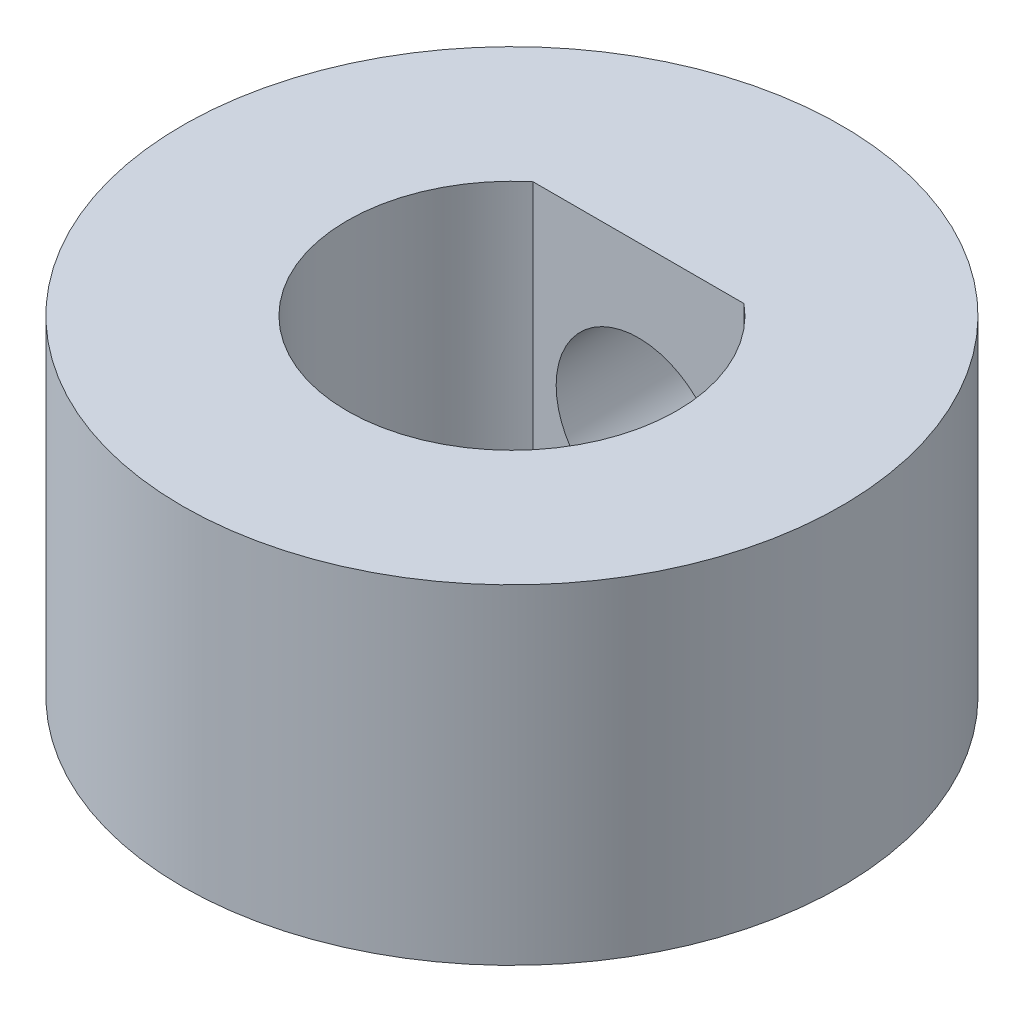
ISO-10303-21;
HEADER;
FILE_DESCRIPTION(('STEP AP214'),'2;1');
FILE_NAME('part.step','',(''),(''),'','','');
FILE_SCHEMA(('AUTOMOTIVE_DESIGN { 1 0 10303 214 1 1 1 1 }'));
ENDSEC;
DATA;
#1=APPLICATION_CONTEXT('core data for automotive mechanical design processes');
#2=APPLICATION_PROTOCOL_DEFINITION('international standard','automotive_design',2000,#1);
#3=PRODUCT_CONTEXT('',#1,'mechanical');
#4=PRODUCT('Part','Part','',(#3));
#5=PRODUCT_RELATED_PRODUCT_CATEGORY('part','',(#4));
#6=PRODUCT_DEFINITION_FORMATION('','',#4);
#7=PRODUCT_DEFINITION_CONTEXT('part definition',#1,'design');
#8=PRODUCT_DEFINITION('design','',#6,#7);
#9=PRODUCT_DEFINITION_SHAPE('','',#8);
#10=(LENGTH_UNIT() NAMED_UNIT(*) SI_UNIT(.MILLI.,.METRE.));
#11=(NAMED_UNIT(*) PLANE_ANGLE_UNIT() SI_UNIT($,.RADIAN.));
#12=(NAMED_UNIT(*) SI_UNIT($,.STERADIAN.) SOLID_ANGLE_UNIT());
#13=UNCERTAINTY_MEASURE_WITH_UNIT(LENGTH_MEASURE(1.E-05),#10,'distance_accuracy_value','');
#14=(GEOMETRIC_REPRESENTATION_CONTEXT(3) GLOBAL_UNCERTAINTY_ASSIGNED_CONTEXT((#13)) GLOBAL_UNIT_ASSIGNED_CONTEXT((#10,
#11,#12)) REPRESENTATION_CONTEXT('',''));
#15=CARTESIAN_POINT('',(0.,0.,0.));
#16=DIRECTION('',(0.,0.,1.));
#17=DIRECTION('',(1.,0.,0.));
#18=AXIS2_PLACEMENT_3D('',#15,#16,#17);
#19=CARTESIAN_POINT('',(0.,6.35,-2.43959033446192));
#20=DIRECTION('',(0.,0.,-1.));
#21=DIRECTION('',(-1.,0.,0.));
#22=AXIS2_PLACEMENT_3D('',#19,#20,#21);
#23=PLANE('',#22);
#24=CARTESIAN_POINT('',(0.,3.175,-2.43959033446191));
#25=DIRECTION('',(0.,0.,-1.));
#26=DIRECTION('',(-1.,0.,0.));
#27=AXIS2_PLACEMENT_3D('',#24,#25,#26);
#28=CIRCLE('',#27,1.5875);
#29=CARTESIAN_POINT('',(-1.5875,3.175,-2.43959033446191));
#30=VERTEX_POINT('',#29);
#31=EDGE_CURVE('E68',#30,#30,#28,.F.);
#32=ORIENTED_EDGE('',*,*,#31,.F.);
#33=EDGE_LOOP('',(#32));
#34=FACE_BOUND('',#33,.T.);
#35=DIRECTION('',(1.,0.,0.));
#36=VECTOR('',#35,1.);
#37=CARTESIAN_POINT('',(0.,0.,-2.43959033446192));
#38=LINE('',#37,#36);
#39=CARTESIAN_POINT('',(-2.032,0.,-2.43959033446192));
#40=VERTEX_POINT('',#39);
#41=CARTESIAN_POINT('',(2.032,0.,-2.43959033446192));
#42=VERTEX_POINT('',#41);
#43=EDGE_CURVE('E59',#40,#42,#38,.T.);
#44=ORIENTED_EDGE('',*,*,#43,.T.);
#45=DIRECTION('',(0.,-1.,0.));
#46=VECTOR('',#45,1.);
#47=CARTESIAN_POINT('',(2.032,6.35,-2.43959033446192));
#48=LINE('',#47,#46);
#49=CARTESIAN_POINT('',(2.032,6.35,-2.43959033446192));
#50=VERTEX_POINT('',#49);
#51=EDGE_CURVE('E11',#50,#42,#48,.T.);
#52=ORIENTED_EDGE('',*,*,#51,.F.);
#53=DIRECTION('',(1.,0.,0.));
#54=VECTOR('',#53,1.);
#55=CARTESIAN_POINT('',(0.,6.35,-2.43959033446192));
#56=LINE('',#55,#54);
#57=CARTESIAN_POINT('',(-2.032,6.35,-2.43959033446192));
#58=VERTEX_POINT('',#57);
#59=EDGE_CURVE('E61',#58,#50,#56,.T.);
#60=ORIENTED_EDGE('',*,*,#59,.F.);
#61=DIRECTION('',(0.,-1.,0.));
#62=VECTOR('',#61,1.);
#63=CARTESIAN_POINT('',(-2.032,6.35,-2.43959033446192));
#64=LINE('',#63,#62);
#65=EDGE_CURVE('E43',#58,#40,#64,.T.);
#66=ORIENTED_EDGE('',*,*,#65,.T.);
#67=EDGE_LOOP('',(#44,#52,#60,#66));
#68=FACE_BOUND('',#67,.T.);
#69=ADVANCED_FACE('F35',(#34,#68),#23,.F.);
#70=CARTESIAN_POINT('',(0.,6.35,0.));
#71=DIRECTION('',(0.,-1.,0.));
#72=DIRECTION('',(0.,0.,-1.));
#73=AXIS2_PLACEMENT_3D('',#70,#71,#72);
#74=CYLINDRICAL_SURFACE('',#73,3.175);
#75=CARTESIAN_POINT('',(0.,0.,0.));
#76=DIRECTION('',(0.,1.,0.));
#77=DIRECTION('',(0.,0.,1.));
#78=AXIS2_PLACEMENT_3D('',#75,#76,#77);
#79=CIRCLE('',#78,3.175);
#80=EDGE_CURVE('E67',#40,#42,#79,.T.);
#81=ORIENTED_EDGE('',*,*,#80,.F.);
#82=ORIENTED_EDGE('',*,*,#65,.F.);
#83=CARTESIAN_POINT('',(0.,6.35,0.));
#84=DIRECTION('',(0.,1.,0.));
#85=DIRECTION('',(0.,0.,1.));
#86=AXIS2_PLACEMENT_3D('',#83,#84,#85);
#87=CIRCLE('',#86,3.175);
#88=EDGE_CURVE('E78',#58,#50,#87,.T.);
#89=ORIENTED_EDGE('',*,*,#88,.T.);
#90=ORIENTED_EDGE('',*,*,#51,.T.);
#91=EDGE_LOOP('',(#81,#82,#89,#90));
#92=FACE_BOUND('',#91,.T.);
#93=ADVANCED_FACE('F70',(#92),#74,.F.);
#94=CARTESIAN_POINT('',(0.,6.35,0.));
#95=DIRECTION('',(0.,-1.,0.));
#96=DIRECTION('',(0.,0.,-1.));
#97=AXIS2_PLACEMENT_3D('',#94,#95,#96);
#98=CYLINDRICAL_SURFACE('',#97,6.35);
#99=CARTESIAN_POINT('',(-1.5875,3.175,-6.14836106210427));
#100=CARTESIAN_POINT('',(-1.58749750990578,3.26266222683713,-6.14836273554171));
#101=CARTESIAN_POINT('',(-1.58021416589079,3.35035201066053,-6.15025634318835));
#102=CARTESIAN_POINT('',(-1.55131968466973,3.52321341214051,-6.15760682365713));
#103=CARTESIAN_POINT('',(-1.5297002087813,3.60838353408739,-6.16306577024851));
#104=CARTESIAN_POINT('',(-1.47287691176629,3.77368024674877,-6.17689090118439));
#105=CARTESIAN_POINT('',(-1.43769062718759,3.8538131936699,-6.18525333108409));
#106=CARTESIAN_POINT('',(-1.35478592470099,4.00704739136285,-6.20393851938293));
#107=CARTESIAN_POINT('',(-1.30706697473604,4.08014834342094,-6.21426136100349));
#108=CARTESIAN_POINT('',(-1.19932985134304,4.2188521447415,-6.23595854885813));
#109=CARTESIAN_POINT('',(-1.13908642369207,4.28427743622228,-6.24734969490624));
#110=CARTESIAN_POINT('',(-1.00849561070392,4.40420848541882,-6.26975425952214));
#111=CARTESIAN_POINT('',(-0.938147281804495,4.45871322226981,-6.28076764269657));
#112=CARTESIAN_POINT('',(-0.788127202685136,4.55598242194586,-6.30136163855569));
#113=CARTESIAN_POINT('',(-0.708339055883901,4.59857245648253,-6.31092011499376));
#114=CARTESIAN_POINT('',(-0.542457122025904,4.66966912403721,-6.32733565573));
#115=CARTESIAN_POINT('',(-0.456364267477882,4.69817783496635,-6.33419311857309));
#116=CARTESIAN_POINT('',(-0.282167811808892,4.7397338749574,-6.34431521868594));
#117=CARTESIAN_POINT('',(-0.194140276913599,4.75308272414738,-6.34764982591139));
#118=CARTESIAN_POINT('',(-0.0170363002318583,4.76488657083998,-6.35059432258134));
#119=CARTESIAN_POINT('',(0.0720399845316736,4.76334377035309,-6.35020476271407));
#120=CARTESIAN_POINT('',(0.246621692386165,4.74562497009116,-6.34579690295494));
#121=CARTESIAN_POINT('',(0.332162492266694,4.7297744335908,-6.34185931486455));
#122=CARTESIAN_POINT('',(0.499329467769227,4.6844132435192,-6.33089181193282));
#123=CARTESIAN_POINT('',(0.58095543475057,4.65490186278535,-6.3238617324801));
#124=CARTESIAN_POINT('',(0.738833141809118,4.58279336761371,-6.30737568660069));
#125=CARTESIAN_POINT('',(0.815029659254325,4.54008042663979,-6.29789837506359));
#126=CARTESIAN_POINT('',(0.959287550465525,4.44286914376118,-6.27754588919127));
#127=CARTESIAN_POINT('',(1.02734750569824,4.38836875146401,-6.26667047179331));
#128=CARTESIAN_POINT('',(1.15534128069737,4.26738494884119,-6.24435958243645));
#129=CARTESIAN_POINT('',(1.21500531553188,4.20061714335916,-6.23291691898958));
#130=CARTESIAN_POINT('',(1.32234999684129,4.05790401680194,-6.21103052633108));
#131=CARTESIAN_POINT('',(1.37003008322305,3.98195826702322,-6.20058684382291));
#132=CARTESIAN_POINT('',(1.45222615482337,3.82251582831541,-6.18185515488097));
#133=CARTESIAN_POINT('',(1.48667718756565,3.73898431125112,-6.17357784665833));
#134=CARTESIAN_POINT('',(1.54096342276019,3.56705822777145,-6.16025336488873));
#135=CARTESIAN_POINT('',(1.56080175290274,3.47866470637071,-6.15520550014489));
#136=CARTESIAN_POINT('',(1.58485182055239,3.30202571653282,-6.14905651084854));
#137=CARTESIAN_POINT('',(1.58946245093896,3.21383800123569,-6.14785466574466));
#138=CARTESIAN_POINT('',(1.58401828897737,3.03795307027287,-6.1492596311046));
#139=CARTESIAN_POINT('',(1.57396484663399,2.95025581020096,-6.15186609096804));
#140=CARTESIAN_POINT('',(1.53982766960041,2.77932244175376,-6.16049747041146));
#141=CARTESIAN_POINT('',(1.51597618335891,2.69603681862751,-6.16646576098828));
#142=CARTESIAN_POINT('',(1.45517748186084,2.53464602426418,-6.18109456102061));
#143=CARTESIAN_POINT('',(1.41822871529747,2.45654146799986,-6.1897553893787));
#144=CARTESIAN_POINT('',(1.33144937413971,2.30603978855423,-6.20900547054222));
#145=CARTESIAN_POINT('',(1.28138031368562,2.23378468657263,-6.21962922065218));
#146=CARTESIAN_POINT('',(1.17008321503345,2.09855538962114,-6.2415234775054));
#147=CARTESIAN_POINT('',(1.10885334300364,2.0355827229272,-6.25279409032578));
#148=CARTESIAN_POINT('',(0.975142069563252,1.91908998796744,-6.2750535092507));
#149=CARTESIAN_POINT('',(0.902417474643903,1.8658458602815,-6.28602820809266));
#150=CARTESIAN_POINT('',(0.748828008777797,1.77232572448596,-6.30616732549721));
#151=CARTESIAN_POINT('',(0.667963562720176,1.73204903995379,-6.31533183847515));
#152=CARTESIAN_POINT('',(0.500948645248106,1.66595676807476,-6.33076023493829));
#153=CARTESIAN_POINT('',(0.414841342381762,1.6400371794193,-6.3370449206423));
#154=CARTESIAN_POINT('',(0.239315244506108,1.60308268752366,-6.34609661306326));
#155=CARTESIAN_POINT('',(0.149897092002975,1.5920449117007,-6.34886429864815));
#156=CARTESIAN_POINT('',(-0.0271200982287803,1.58532895154884,-6.35054243936488));
#157=CARTESIAN_POINT('',(-0.114702950308577,1.58924353681107,-6.34955516472013));
#158=CARTESIAN_POINT('',(-0.287920900558399,1.61138842582975,-6.3440611062616));
#159=CARTESIAN_POINT('',(-0.373556056577157,1.6296183038333,-6.33955442711888));
#160=CARTESIAN_POINT('',(-0.540021519086145,1.67965789888635,-6.32754374655666));
#161=CARTESIAN_POINT('',(-0.620875210147367,1.71139398213697,-6.32005601147982));
#162=CARTESIAN_POINT('',(-0.776155821703331,1.78747829419318,-6.30287171149997));
#163=CARTESIAN_POINT('',(-0.850581930508269,1.83182811286294,-6.29317486818656));
#164=CARTESIAN_POINT('',(-0.99282556137294,1.93312293397035,-6.27232758869116));
#165=CARTESIAN_POINT('',(-1.06044204392718,1.99034422686546,-6.26114789401158));
#166=CARTESIAN_POINT('',(-1.18525134468062,2.1152212775084,-6.23872655372022));
#167=CARTESIAN_POINT('',(-1.24244151604575,2.18287967680543,-6.22748489312182));
#168=CARTESIAN_POINT('',(-1.34582221703577,2.32822974504462,-6.2059736792862));
#169=CARTESIAN_POINT('',(-1.3917876333714,2.40608504591755,-6.19572617421192));
#170=CARTESIAN_POINT('',(-1.46990894837737,2.56866309025229,-6.17766029436602));
#171=CARTESIAN_POINT('',(-1.50207489424355,2.65338078369445,-6.16984015341641));
#172=CARTESIAN_POINT('',(-1.54689576409763,2.81079100627491,-6.15873655124406));
#173=CARTESIAN_POINT('',(-1.56208915832016,2.88273039845938,-6.15487502513368));
#174=CARTESIAN_POINT('',(-1.58239188946006,3.02810682953744,-6.14968668754596));
#175=CARTESIAN_POINT('',(-1.58750208656584,3.10154374013903,-6.14835965985316));
#176=CARTESIAN_POINT('',(-1.5875,3.175,-6.14836106210427));
#177=B_SPLINE_CURVE_WITH_KNOTS('',3,(#99,#100,#101,#102,#103,#104,#105,#106,#107,#108,#109,#110,
#111,#112,#113,#114,#115,#116,#117,#118,#119,#120,#121,#122,#123,#124,#125,#126,#127,#128,#129,
#130,#131,#132,#133,#134,#135,#136,#137,#138,#139,#140,#141,#142,#143,#144,#145,#146,#147,#148,
#149,#150,#151,#152,#153,#154,#155,#156,#157,#158,#159,#160,#161,#162,#163,#164,#165,#166,#167,
#168,#169,#170,#171,#172,#173,#174,#175,#176),.UNSPECIFIED.,.T.,.F.,(4,2,2,2,2,2,2,2,2,2,2,2,2,
2,2,2,2,2,2,2,2,2,2,2,2,2,2,2,2,2,2,2,2,2,2,2,2,2,4),(0.,0.262716925502447,0.525586795807203,
0.788118011750423,1.05066037489729,1.3184121091254,1.58618886139715,1.85770200212679,
2.12917506502904,2.39514856882045,2.66108274402923,2.92111596807481,3.18116303520239,
3.44355975151572,3.7060021477276,3.97554746273164,4.24510537311874,4.51597034325335,
4.78677732082263,5.0504316997369,5.31406180761714,5.57337852180846,5.832725961026,
6.09716107120565,6.36163966992003,6.63273585162977,6.90381788981916,7.172909662324,
7.44194948557239,7.70371488290935,7.96547249534383,8.22582096615416,8.48620226643676,
8.75282156329615,9.01950845044098,9.29117063075769,9.56263468067803,9.78279620257604,
10.002938941882),.UNSPECIFIED.);
#178=CARTESIAN_POINT('',(-1.5875,3.175,-6.14836106210427));
#179=VERTEX_POINT('',#178);
#180=EDGE_CURVE('E81',#179,#179,#177,.T.);
#181=ORIENTED_EDGE('',*,*,#180,.F.);
#182=EDGE_LOOP('',(#181));
#183=FACE_BOUND('',#182,.T.);
#184=CARTESIAN_POINT('',(0.,6.35,0.));
#185=DIRECTION('',(0.,1.,0.));
#186=DIRECTION('',(0.,0.,1.));
#187=AXIS2_PLACEMENT_3D('',#184,#185,#186);
#188=CIRCLE('',#187,6.35);
#189=CARTESIAN_POINT('',(0.,6.35,6.35));
#190=VERTEX_POINT('',#189);
#191=EDGE_CURVE('E63',#190,#190,#188,.T.);
#192=ORIENTED_EDGE('',*,*,#191,.F.);
#193=EDGE_LOOP('',(#192));
#194=FACE_BOUND('',#193,.T.);
#195=CARTESIAN_POINT('',(0.,0.,0.));
#196=DIRECTION('',(0.,1.,0.));
#197=DIRECTION('',(0.,0.,1.));
#198=AXIS2_PLACEMENT_3D('',#195,#196,#197);
#199=CIRCLE('',#198,6.35);
#200=CARTESIAN_POINT('',(0.,0.,6.35));
#201=VERTEX_POINT('',#200);
#202=EDGE_CURVE('E71',#201,#201,#199,.T.);
#203=ORIENTED_EDGE('',*,*,#202,.T.);
#204=EDGE_LOOP('',(#203));
#205=FACE_BOUND('',#204,.T.);
#206=ADVANCED_FACE('F98',(#183,#194,#205),#98,.T.);
#207=CARTESIAN_POINT('',(0.,6.35,0.));
#208=DIRECTION('',(0.,1.,0.));
#209=DIRECTION('',(0.,0.,1.));
#210=AXIS2_PLACEMENT_3D('',#207,#208,#209);
#211=PLANE('',#210);
#212=ORIENTED_EDGE('',*,*,#59,.T.);
#213=ORIENTED_EDGE('',*,*,#88,.F.);
#214=EDGE_LOOP('',(#212,#213));
#215=FACE_BOUND('',#214,.T.);
#216=ORIENTED_EDGE('',*,*,#191,.T.);
#217=EDGE_LOOP('',(#216));
#218=FACE_BOUND('',#217,.T.);
#219=ADVANCED_FACE('F95',(#215,#218),#211,.T.);
#220=CARTESIAN_POINT('',(0.,0.,0.));
#221=DIRECTION('',(0.,1.,0.));
#222=DIRECTION('',(0.,0.,1.));
#223=AXIS2_PLACEMENT_3D('',#220,#221,#222);
#224=PLANE('',#223);
#225=ORIENTED_EDGE('',*,*,#43,.F.);
#226=ORIENTED_EDGE('',*,*,#80,.T.);
#227=EDGE_LOOP('',(#225,#226));
#228=FACE_BOUND('',#227,.T.);
#229=ORIENTED_EDGE('',*,*,#202,.F.);
#230=EDGE_LOOP('',(#229));
#231=FACE_BOUND('',#230,.T.);
#232=ADVANCED_FACE('F65',(#228,#231),#224,.F.);
#233=CARTESIAN_POINT('',(0.,3.175,6.351));
#234=DIRECTION('',(0.,0.,-1.));
#235=DIRECTION('',(-1.,0.,0.));
#236=AXIS2_PLACEMENT_3D('',#233,#234,#235);
#237=CYLINDRICAL_SURFACE('',#236,1.5875);
#238=ORIENTED_EDGE('',*,*,#180,.T.);
#239=EDGE_LOOP('',(#238));
#240=FACE_BOUND('',#239,.T.);
#241=ORIENTED_EDGE('',*,*,#31,.T.);
#242=EDGE_LOOP('',(#241));
#243=FACE_BOUND('',#242,.T.);
#244=ADVANCED_FACE('F89',(#240,#243),#237,.F.);
#245=CLOSED_SHELL('',(#69,#93,#206,#219,#232,#244));
#246=MANIFOLD_SOLID_BREP('B2',#245);
#247=ADVANCED_BREP_SHAPE_REPRESENTATION('',(#18,#246),#14);
#248=SHAPE_DEFINITION_REPRESENTATION(#9,#247);
ENDSEC;
END-ISO-10303-21;
